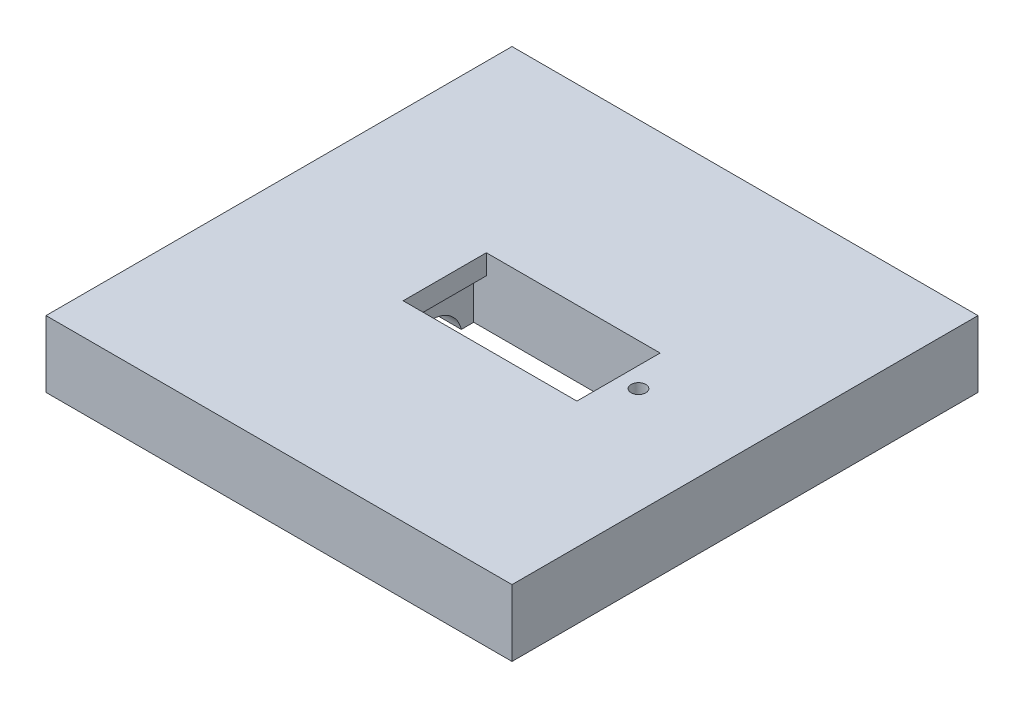
ISO-10303-21;
HEADER;
FILE_DESCRIPTION(('STEP AP214'),'2;1');
FILE_NAME('part.step','',(''),(''),'','','');
FILE_SCHEMA(('AUTOMOTIVE_DESIGN { 1 0 10303 214 1 1 1 1 }'));
ENDSEC;
DATA;
#1=APPLICATION_CONTEXT('core data for automotive mechanical design processes');
#2=APPLICATION_PROTOCOL_DEFINITION('international standard','automotive_design',2000,#1);
#3=PRODUCT_CONTEXT('',#1,'mechanical');
#4=PRODUCT('Part','Part','',(#3));
#5=PRODUCT_RELATED_PRODUCT_CATEGORY('part','',(#4));
#6=PRODUCT_DEFINITION_FORMATION('','',#4);
#7=PRODUCT_DEFINITION_CONTEXT('part definition',#1,'design');
#8=PRODUCT_DEFINITION('design','',#6,#7);
#9=PRODUCT_DEFINITION_SHAPE('','',#8);
#10=(LENGTH_UNIT() NAMED_UNIT(*) SI_UNIT(.MILLI.,.METRE.));
#11=(NAMED_UNIT(*) PLANE_ANGLE_UNIT() SI_UNIT($,.RADIAN.));
#12=(NAMED_UNIT(*) SI_UNIT($,.STERADIAN.) SOLID_ANGLE_UNIT());
#13=UNCERTAINTY_MEASURE_WITH_UNIT(LENGTH_MEASURE(1.E-05),#10,'distance_accuracy_value','');
#14=(GEOMETRIC_REPRESENTATION_CONTEXT(3) GLOBAL_UNCERTAINTY_ASSIGNED_CONTEXT((#13)) GLOBAL_UNIT_ASSIGNED_CONTEXT((#10,
#11,#12)) REPRESENTATION_CONTEXT('',''));
#15=CARTESIAN_POINT('',(0.,0.,0.));
#16=DIRECTION('',(0.,0.,1.));
#17=DIRECTION('',(1.,0.,0.));
#18=AXIS2_PLACEMENT_3D('',#15,#16,#17);
#19=CARTESIAN_POINT('',(-35.001,46.,22.1));
#20=DIRECTION('',(1.,0.,0.));
#21=DIRECTION('',(0.,0.,-1.));
#22=AXIS2_PLACEMENT_3D('',#19,#20,#21);
#23=CYLINDRICAL_SURFACE('',#22,4.50000000000001);
#24=DIRECTION('',(1.,0.,0.));
#25=VECTOR('',#24,1.);
#26=CARTESIAN_POINT('',(-35.001,45.0001693639848,17.7124792081079));
#27=LINE('',#26,#25);
#28=CARTESIAN_POINT('',(-35.,45.0001693639848,17.7124792081079));
#29=VERTEX_POINT('',#28);
#30=CARTESIAN_POINT('',(-12.,45.0001693639848,17.7124792081079));
#31=VERTEX_POINT('',#30);
#32=EDGE_CURVE('E331',#29,#31,#27,.T.);
#33=ORIENTED_EDGE('',*,*,#32,.T.);
#34=CARTESIAN_POINT('',(-12.,46.,22.1));
#35=DIRECTION('',(1.,0.,0.));
#36=DIRECTION('',(0.,0.,-1.));
#37=AXIS2_PLACEMENT_3D('',#34,#35,#36);
#38=CIRCLE('',#37,4.50000000000001);
#39=CARTESIAN_POINT('',(-12.,45.0001693639848,26.4875207918921));
#40=VERTEX_POINT('',#39);
#41=EDGE_CURVE('E238',#40,#31,#38,.F.);
#42=ORIENTED_EDGE('',*,*,#41,.F.);
#43=DIRECTION('',(1.,0.,0.));
#44=VECTOR('',#43,1.);
#45=CARTESIAN_POINT('',(-35.001,45.0001693639848,26.4875207918921));
#46=LINE('',#45,#44);
#47=CARTESIAN_POINT('',(-35.,45.0001693639848,26.4875207918921));
#48=VERTEX_POINT('',#47);
#49=EDGE_CURVE('E308',#40,#48,#46,.F.);
#50=ORIENTED_EDGE('',*,*,#49,.T.);
#51=CARTESIAN_POINT('',(-35.,46.,22.1));
#52=DIRECTION('',(1.,0.,0.));
#53=DIRECTION('',(0.,0.,-1.));
#54=AXIS2_PLACEMENT_3D('',#51,#52,#53);
#55=CIRCLE('',#54,4.50000000000001);
#56=EDGE_CURVE('E199',#48,#29,#55,.F.);
#57=ORIENTED_EDGE('',*,*,#56,.T.);
#58=EDGE_LOOP('',(#33,#42,#50,#57));
#59=FACE_BOUND('',#58,.T.);
#60=ADVANCED_FACE('F37',(#59),#23,.F.);
#61=CARTESIAN_POINT('',(-35.001,44.,0.));
#62=DIRECTION('',(1.,0.,0.));
#63=DIRECTION('',(0.,0.,-1.));
#64=AXIS2_PLACEMENT_3D('',#61,#62,#63);
#65=CYLINDRICAL_SURFACE('',#64,4.5);
#66=DIRECTION('',(1.,0.,0.));
#67=VECTOR('',#66,1.);
#68=CARTESIAN_POINT('',(-35.001,45.0001693639848,-4.38744358862266));
#69=LINE('',#68,#67);
#70=CARTESIAN_POINT('',(-35.,45.0001693639848,-4.38744358862266));
#71=VERTEX_POINT('',#70);
#72=CARTESIAN_POINT('',(-12.,45.0001693639848,-4.38744358862267));
#73=VERTEX_POINT('',#72);
#74=EDGE_CURVE('E271',#71,#73,#69,.T.);
#75=ORIENTED_EDGE('',*,*,#74,.T.);
#76=CARTESIAN_POINT('',(-12.,44.,0.));
#77=DIRECTION('',(1.,0.,0.));
#78=DIRECTION('',(0.,0.,-1.));
#79=AXIS2_PLACEMENT_3D('',#76,#77,#78);
#80=CIRCLE('',#79,4.5);
#81=CARTESIAN_POINT('',(-12.,45.0001693639848,4.38744358862267));
#82=VERTEX_POINT('',#81);
#83=EDGE_CURVE('E183',#82,#73,#80,.F.);
#84=ORIENTED_EDGE('',*,*,#83,.F.);
#85=DIRECTION('',(1.,0.,0.));
#86=VECTOR('',#85,1.);
#87=CARTESIAN_POINT('',(-35.001,45.0001693639848,4.38744358862267));
#88=LINE('',#87,#86);
#89=CARTESIAN_POINT('',(-35.,45.0001693639848,4.38744358862267));
#90=VERTEX_POINT('',#89);
#91=EDGE_CURVE('E277',#82,#90,#88,.F.);
#92=ORIENTED_EDGE('',*,*,#91,.T.);
#93=CARTESIAN_POINT('',(-35.,44.,0.));
#94=DIRECTION('',(1.,0.,0.));
#95=DIRECTION('',(0.,0.,-1.));
#96=AXIS2_PLACEMENT_3D('',#93,#94,#95);
#97=CIRCLE('',#96,4.5);
#98=EDGE_CURVE('E214',#90,#71,#97,.F.);
#99=ORIENTED_EDGE('',*,*,#98,.T.);
#100=EDGE_LOOP('',(#75,#84,#92,#99));
#101=FACE_BOUND('',#100,.T.);
#102=ADVANCED_FACE('F276',(#101),#65,.F.);
#103=CARTESIAN_POINT('',(35.,64.,-35.));
#104=DIRECTION('',(-1.,0.,0.));
#105=DIRECTION('',(0.,0.,1.));
#106=AXIS2_PLACEMENT_3D('',#103,#104,#105);
#107=PLANE('',#106);
#108=DIRECTION('',(0.,0.,-1.));
#109=VECTOR('',#108,1.);
#110=CARTESIAN_POINT('',(35.,45.0001693639848,0.));
#111=LINE('',#110,#109);
#112=CARTESIAN_POINT('',(35.,45.0001693639848,35.));
#113=VERTEX_POINT('',#112);
#114=CARTESIAN_POINT('',(35.,45.0001693639848,-35.));
#115=VERTEX_POINT('',#114);
#116=EDGE_CURVE('E326',#113,#115,#111,.T.);
#117=ORIENTED_EDGE('',*,*,#116,.T.);
#118=DIRECTION('',(0.,-1.,0.));
#119=VECTOR('',#118,1.);
#120=CARTESIAN_POINT('',(35.,64.,-35.));
#121=LINE('',#120,#119);
#122=CARTESIAN_POINT('',(35.,55.,-35.));
#123=VERTEX_POINT('',#122);
#124=EDGE_CURVE('E45',#123,#115,#121,.T.);
#125=ORIENTED_EDGE('',*,*,#124,.F.);
#126=DIRECTION('',(0.,0.,-1.));
#127=VECTOR('',#126,1.);
#128=CARTESIAN_POINT('',(35.,55.,35.));
#129=LINE('',#128,#127);
#130=CARTESIAN_POINT('',(35.,55.,35.));
#131=VERTEX_POINT('',#130);
#132=EDGE_CURVE('E240',#131,#123,#129,.T.);
#133=ORIENTED_EDGE('',*,*,#132,.F.);
#134=DIRECTION('',(0.,-1.,0.));
#135=VECTOR('',#134,1.);
#136=CARTESIAN_POINT('',(35.,64.,35.));
#137=LINE('',#136,#135);
#138=EDGE_CURVE('E225',#131,#113,#137,.T.);
#139=ORIENTED_EDGE('',*,*,#138,.T.);
#140=EDGE_LOOP('',(#117,#125,#133,#139));
#141=FACE_BOUND('',#140,.T.);
#142=ADVANCED_FACE('F39',(#141),#107,.F.);
#143=CARTESIAN_POINT('',(-35.,64.,-35.));
#144=DIRECTION('',(0.,0.,1.));
#145=DIRECTION('',(1.,0.,0.));
#146=AXIS2_PLACEMENT_3D('',#143,#144,#145);
#147=PLANE('',#146);
#148=DIRECTION('',(-1.,0.,0.));
#149=VECTOR('',#148,1.);
#150=CARTESIAN_POINT('',(0.,45.0001693639848,-35.));
#151=LINE('',#150,#149);
#152=CARTESIAN_POINT('',(-35.,45.0001693639848,-35.));
#153=VERTEX_POINT('',#152);
#154=EDGE_CURVE('E329',#115,#153,#151,.T.);
#155=ORIENTED_EDGE('',*,*,#154,.T.);
#156=DIRECTION('',(0.,-1.,0.));
#157=VECTOR('',#156,1.);
#158=CARTESIAN_POINT('',(-35.,64.,-35.));
#159=LINE('',#158,#157);
#160=CARTESIAN_POINT('',(-35.,55.,-35.));
#161=VERTEX_POINT('',#160);
#162=EDGE_CURVE('E232',#161,#153,#159,.T.);
#163=ORIENTED_EDGE('',*,*,#162,.F.);
#164=DIRECTION('',(1.,0.,0.));
#165=VECTOR('',#164,1.);
#166=CARTESIAN_POINT('',(-35.001,55.,-35.));
#167=LINE('',#166,#165);
#168=EDGE_CURVE('E256',#161,#123,#167,.T.);
#169=ORIENTED_EDGE('',*,*,#168,.T.);
#170=ORIENTED_EDGE('',*,*,#124,.T.);
#171=EDGE_LOOP('',(#155,#163,#169,#170));
#172=FACE_BOUND('',#171,.T.);
#173=ADVANCED_FACE('F342',(#172),#147,.F.);
#174=CARTESIAN_POINT('',(-35.,64.,-35.));
#175=DIRECTION('',(1.,0.,0.));
#176=DIRECTION('',(0.,0.,-1.));
#177=AXIS2_PLACEMENT_3D('',#174,#175,#176);
#178=PLANE('',#177);
#179=DIRECTION('',(0.,0.,1.));
#180=VECTOR('',#179,1.);
#181=CARTESIAN_POINT('',(-35.,45.0001693639848,0.));
#182=LINE('',#181,#180);
#183=CARTESIAN_POINT('',(-35.,45.0001693639848,35.));
#184=VERTEX_POINT('',#183);
#185=EDGE_CURVE('E318',#48,#184,#182,.T.);
#186=ORIENTED_EDGE('',*,*,#185,.T.);
#187=DIRECTION('',(0.,-1.,0.));
#188=VECTOR('',#187,1.);
#189=CARTESIAN_POINT('',(-35.,64.,35.));
#190=LINE('',#189,#188);
#191=CARTESIAN_POINT('',(-35.,55.,35.));
#192=VERTEX_POINT('',#191);
#193=EDGE_CURVE('E229',#192,#184,#190,.T.);
#194=ORIENTED_EDGE('',*,*,#193,.F.);
#195=DIRECTION('',(0.,0.,1.));
#196=VECTOR('',#195,1.);
#197=CARTESIAN_POINT('',(-35.,55.,35.));
#198=LINE('',#197,#196);
#199=EDGE_CURVE('E259',#161,#192,#198,.T.);
#200=ORIENTED_EDGE('',*,*,#199,.F.);
#201=ORIENTED_EDGE('',*,*,#162,.T.);
#202=EDGE_CURVE('E281',#153,#71,#182,.T.);
#203=ORIENTED_EDGE('',*,*,#202,.T.);
#204=ORIENTED_EDGE('',*,*,#98,.F.);
#205=EDGE_CURVE('E321',#90,#29,#182,.T.);
#206=ORIENTED_EDGE('',*,*,#205,.T.);
#207=ORIENTED_EDGE('',*,*,#56,.F.);
#208=EDGE_LOOP('',(#186,#194,#200,#201,#203,#204,#206,#207));
#209=FACE_BOUND('',#208,.T.);
#210=ADVANCED_FACE('F337',(#209),#178,.F.);
#211=CARTESIAN_POINT('',(-35.,64.,35.));
#212=DIRECTION('',(0.,0.,-1.));
#213=DIRECTION('',(-1.,0.,0.));
#214=AXIS2_PLACEMENT_3D('',#211,#212,#213);
#215=PLANE('',#214);
#216=DIRECTION('',(1.,0.,0.));
#217=VECTOR('',#216,1.);
#218=CARTESIAN_POINT('',(0.,45.0001693639848,35.));
#219=LINE('',#218,#217);
#220=EDGE_CURVE('E323',#184,#113,#219,.T.);
#221=ORIENTED_EDGE('',*,*,#220,.T.);
#222=ORIENTED_EDGE('',*,*,#138,.F.);
#223=DIRECTION('',(1.,0.,0.));
#224=VECTOR('',#223,1.);
#225=CARTESIAN_POINT('',(-35.001,55.,35.));
#226=LINE('',#225,#224);
#227=EDGE_CURVE('E245',#192,#131,#226,.T.);
#228=ORIENTED_EDGE('',*,*,#227,.F.);
#229=ORIENTED_EDGE('',*,*,#193,.T.);
#230=EDGE_LOOP('',(#221,#222,#228,#229));
#231=FACE_BOUND('',#230,.T.);
#232=ADVANCED_FACE('F348',(#231),#215,.F.);
#233=CARTESIAN_POINT('',(16.,39.,6.));
#234=DIRECTION('',(1.,0.,0.));
#235=DIRECTION('',(0.,0.,-1.));
#236=AXIS2_PLACEMENT_3D('',#233,#234,#235);
#237=PLANE('',#236);
#238=DIRECTION('',(0.,0.,1.));
#239=VECTOR('',#238,1.);
#240=CARTESIAN_POINT('',(16.,45.0001693639848,0.));
#241=LINE('',#240,#239);
#242=CARTESIAN_POINT('',(16.,45.0001693639848,-6.25));
#243=VERTEX_POINT('',#242);
#244=CARTESIAN_POINT('',(16.,45.0001693639848,6.25));
#245=VERTEX_POINT('',#244);
#246=EDGE_CURVE('E290',#243,#245,#241,.T.);
#247=ORIENTED_EDGE('',*,*,#246,.T.);
#248=DIRECTION('',(0.,1.,0.));
#249=VECTOR('',#248,1.);
#250=CARTESIAN_POINT('',(16.,39.,6.25));
#251=LINE('',#250,#249);
#252=CARTESIAN_POINT('',(16.,55.,6.25));
#253=VERTEX_POINT('',#252);
#254=EDGE_CURVE('E223',#245,#253,#251,.T.);
#255=ORIENTED_EDGE('',*,*,#254,.T.);
#256=DIRECTION('',(0.,0.,-1.));
#257=VECTOR('',#256,1.);
#258=CARTESIAN_POINT('',(16.,55.,6.));
#259=LINE('',#258,#257);
#260=CARTESIAN_POINT('',(16.,55.,-6.25));
#261=VERTEX_POINT('',#260);
#262=EDGE_CURVE('E196',#253,#261,#259,.T.);
#263=ORIENTED_EDGE('',*,*,#262,.T.);
#264=DIRECTION('',(0.,1.,0.));
#265=VECTOR('',#264,1.);
#266=CARTESIAN_POINT('',(16.,39.,-6.25));
#267=LINE('',#266,#265);
#268=EDGE_CURVE('E222',#243,#261,#267,.T.);
#269=ORIENTED_EDGE('',*,*,#268,.F.);
#270=EDGE_LOOP('',(#247,#255,#263,#269));
#271=FACE_BOUND('',#270,.T.);
#272=ADVANCED_FACE('F380',(#271),#237,.F.);
#273=CARTESIAN_POINT('',(16.,39.,6.25));
#274=DIRECTION('',(0.,0.,1.));
#275=DIRECTION('',(1.,0.,0.));
#276=AXIS2_PLACEMENT_3D('',#273,#274,#275);
#277=PLANE('',#276);
#278=DIRECTION('',(0.,-1.,0.));
#279=VECTOR('',#278,1.);
#280=CARTESIAN_POINT('',(-10.1,55.001,6.25));
#281=LINE('',#280,#279);
#282=CARTESIAN_POINT('',(-10.1,55.,6.25));
#283=VERTEX_POINT('',#282);
#284=CARTESIAN_POINT('',(-10.1,51.9986853970522,6.25));
#285=VERTEX_POINT('',#284);
#286=EDGE_CURVE('E171',#283,#285,#281,.T.);
#287=ORIENTED_EDGE('',*,*,#286,.F.);
#288=DIRECTION('',(1.,0.,0.));
#289=VECTOR('',#288,1.);
#290=CARTESIAN_POINT('',(16.,55.,6.25));
#291=LINE('',#290,#289);
#292=EDGE_CURVE('E194',#283,#253,#291,.T.);
#293=ORIENTED_EDGE('',*,*,#292,.T.);
#294=ORIENTED_EDGE('',*,*,#254,.F.);
#295=DIRECTION('',(-1.,0.,0.));
#296=VECTOR('',#295,1.);
#297=CARTESIAN_POINT('',(0.,45.0001693639848,6.25));
#298=LINE('',#297,#296);
#299=CARTESIAN_POINT('',(-12.,45.0001693639848,6.25));
#300=VERTEX_POINT('',#299);
#301=EDGE_CURVE('E288',#245,#300,#298,.T.);
#302=ORIENTED_EDGE('',*,*,#301,.T.);
#303=DIRECTION('',(0.,-1.,0.));
#304=VECTOR('',#303,1.);
#305=CARTESIAN_POINT('',(-12.,51.9986853970522,6.25));
#306=LINE('',#305,#304);
#307=CARTESIAN_POINT('',(-12.,51.9986853970522,6.25));
#308=VERTEX_POINT('',#307);
#309=EDGE_CURVE('E181',#308,#300,#306,.T.);
#310=ORIENTED_EDGE('',*,*,#309,.F.);
#311=DIRECTION('',(1.,0.,0.));
#312=VECTOR('',#311,1.);
#313=CARTESIAN_POINT('',(-12.,51.9986853970522,6.25));
#314=LINE('',#313,#312);
#315=EDGE_CURVE('E165',#308,#285,#314,.T.);
#316=ORIENTED_EDGE('',*,*,#315,.T.);
#317=EDGE_LOOP('',(#287,#293,#294,#302,#310,#316));
#318=FACE_BOUND('',#317,.T.);
#319=ADVANCED_FACE('F178',(#318),#277,.F.);
#320=CARTESIAN_POINT('',(-7.,39.,-6.25));
#321=DIRECTION('',(0.,0.,-1.));
#322=DIRECTION('',(-1.,0.,0.));
#323=AXIS2_PLACEMENT_3D('',#320,#321,#322);
#324=PLANE('',#323);
#325=DIRECTION('',(-1.,0.,0.));
#326=VECTOR('',#325,1.);
#327=CARTESIAN_POINT('',(-7.,55.,-6.25));
#328=LINE('',#327,#326);
#329=CARTESIAN_POINT('',(-10.1,55.,-6.25));
#330=VERTEX_POINT('',#329);
#331=EDGE_CURVE('E192',#261,#330,#328,.T.);
#332=ORIENTED_EDGE('',*,*,#331,.T.);
#333=DIRECTION('',(0.,-1.,0.));
#334=VECTOR('',#333,1.);
#335=CARTESIAN_POINT('',(-10.1,55.001,-6.25));
#336=LINE('',#335,#334);
#337=CARTESIAN_POINT('',(-10.1,51.9986853970522,-6.25));
#338=VERTEX_POINT('',#337);
#339=EDGE_CURVE('E52',#330,#338,#336,.T.);
#340=ORIENTED_EDGE('',*,*,#339,.T.);
#341=DIRECTION('',(1.,0.,0.));
#342=VECTOR('',#341,1.);
#343=CARTESIAN_POINT('',(-12.,51.9986853970522,-6.25));
#344=LINE('',#343,#342);
#345=CARTESIAN_POINT('',(-12.,51.9986853970522,-6.25));
#346=VERTEX_POINT('',#345);
#347=EDGE_CURVE('E167',#346,#338,#344,.T.);
#348=ORIENTED_EDGE('',*,*,#347,.F.);
#349=DIRECTION('',(0.,1.,0.));
#350=VECTOR('',#349,1.);
#351=CARTESIAN_POINT('',(-12.,39.,-6.25));
#352=LINE('',#351,#350);
#353=CARTESIAN_POINT('',(-12.,45.0001693639848,-6.25));
#354=VERTEX_POINT('',#353);
#355=EDGE_CURVE('E262',#354,#346,#352,.T.);
#356=ORIENTED_EDGE('',*,*,#355,.F.);
#357=DIRECTION('',(1.,0.,0.));
#358=VECTOR('',#357,1.);
#359=CARTESIAN_POINT('',(0.,45.0001693639848,-6.25));
#360=LINE('',#359,#358);
#361=EDGE_CURVE('E285',#354,#243,#360,.T.);
#362=ORIENTED_EDGE('',*,*,#361,.T.);
#363=ORIENTED_EDGE('',*,*,#268,.T.);
#364=EDGE_LOOP('',(#332,#340,#348,#356,#362,#363));
#365=FACE_BOUND('',#364,.T.);
#366=ADVANCED_FACE('F370',(#365),#324,.F.);
#367=CARTESIAN_POINT('',(-7.,51.,28.2));
#368=DIRECTION('',(0.,0.,1.));
#369=DIRECTION('',(1.,0.,0.));
#370=AXIS2_PLACEMENT_3D('',#367,#368,#369);
#371=PLANE('',#370);
#372=DIRECTION('',(-1.,0.,0.));
#373=VECTOR('',#372,1.);
#374=CARTESIAN_POINT('',(0.,45.0001693639848,28.2));
#375=LINE('',#374,#373);
#376=CARTESIAN_POINT('',(16.,45.0001693639848,28.2));
#377=VERTEX_POINT('',#376);
#378=CARTESIAN_POINT('',(-12.,45.0001693639848,28.2));
#379=VERTEX_POINT('',#378);
#380=EDGE_CURVE('E306',#377,#379,#375,.T.);
#381=ORIENTED_EDGE('',*,*,#380,.T.);
#382=DIRECTION('',(0.,-1.,0.));
#383=VECTOR('',#382,1.);
#384=CARTESIAN_POINT('',(-12.,51.,28.2));
#385=LINE('',#384,#383);
#386=CARTESIAN_POINT('',(-12.,51.,28.2));
#387=VERTEX_POINT('',#386);
#388=EDGE_CURVE('E241',#387,#379,#385,.T.);
#389=ORIENTED_EDGE('',*,*,#388,.F.);
#390=DIRECTION('',(-1.,0.,0.));
#391=VECTOR('',#390,1.);
#392=CARTESIAN_POINT('',(-7.,51.,28.2));
#393=LINE('',#392,#391);
#394=CARTESIAN_POINT('',(16.,51.,28.2));
#395=VERTEX_POINT('',#394);
#396=EDGE_CURVE('E202',#395,#387,#393,.T.);
#397=ORIENTED_EDGE('',*,*,#396,.F.);
#398=DIRECTION('',(0.,-1.,0.));
#399=VECTOR('',#398,1.);
#400=CARTESIAN_POINT('',(16.,51.,28.2));
#401=LINE('',#400,#399);
#402=EDGE_CURVE('E211',#395,#377,#401,.T.);
#403=ORIENTED_EDGE('',*,*,#402,.T.);
#404=EDGE_LOOP('',(#381,#389,#397,#403));
#405=FACE_BOUND('',#404,.T.);
#406=ADVANCED_FACE('F305',(#405),#371,.F.);
#407=CARTESIAN_POINT('',(16.,51.,16.));
#408=DIRECTION('',(1.,0.,0.));
#409=DIRECTION('',(0.,0.,-1.));
#410=AXIS2_PLACEMENT_3D('',#407,#408,#409);
#411=PLANE('',#410);
#412=DIRECTION('',(0.,0.,1.));
#413=VECTOR('',#412,1.);
#414=CARTESIAN_POINT('',(16.,45.0001693639848,0.));
#415=LINE('',#414,#413);
#416=CARTESIAN_POINT('',(16.,45.0001693639848,16.));
#417=VERTEX_POINT('',#416);
#418=EDGE_CURVE('E312',#417,#377,#415,.T.);
#419=ORIENTED_EDGE('',*,*,#418,.T.);
#420=ORIENTED_EDGE('',*,*,#402,.F.);
#421=DIRECTION('',(0.,0.,1.));
#422=VECTOR('',#421,1.);
#423=CARTESIAN_POINT('',(16.,51.,16.));
#424=LINE('',#423,#422);
#425=CARTESIAN_POINT('',(16.,51.,16.));
#426=VERTEX_POINT('',#425);
#427=EDGE_CURVE('E207',#426,#395,#424,.T.);
#428=ORIENTED_EDGE('',*,*,#427,.F.);
#429=DIRECTION('',(0.,-1.,0.));
#430=VECTOR('',#429,1.);
#431=CARTESIAN_POINT('',(16.,51.,16.));
#432=LINE('',#431,#430);
#433=EDGE_CURVE('E210',#426,#417,#432,.T.);
#434=ORIENTED_EDGE('',*,*,#433,.T.);
#435=EDGE_LOOP('',(#419,#420,#428,#434));
#436=FACE_BOUND('',#435,.T.);
#437=ADVANCED_FACE('F363',(#436),#411,.F.);
#438=CARTESIAN_POINT('',(-7.,51.,16.));
#439=DIRECTION('',(0.,0.,-1.));
#440=DIRECTION('',(-1.,0.,0.));
#441=AXIS2_PLACEMENT_3D('',#438,#439,#440);
#442=PLANE('',#441);
#443=DIRECTION('',(1.,0.,0.));
#444=VECTOR('',#443,1.);
#445=CARTESIAN_POINT('',(0.,45.0001693639848,16.));
#446=LINE('',#445,#444);
#447=CARTESIAN_POINT('',(-12.,45.0001693639848,16.));
#448=VERTEX_POINT('',#447);
#449=EDGE_CURVE('E60',#448,#417,#446,.T.);
#450=ORIENTED_EDGE('',*,*,#449,.T.);
#451=ORIENTED_EDGE('',*,*,#433,.F.);
#452=DIRECTION('',(1.,0.,0.));
#453=VECTOR('',#452,1.);
#454=CARTESIAN_POINT('',(-7.,51.,16.));
#455=LINE('',#454,#453);
#456=CARTESIAN_POINT('',(-12.,51.,16.));
#457=VERTEX_POINT('',#456);
#458=EDGE_CURVE('E204',#457,#426,#455,.T.);
#459=ORIENTED_EDGE('',*,*,#458,.F.);
#460=DIRECTION('',(0.,1.,0.));
#461=VECTOR('',#460,1.);
#462=CARTESIAN_POINT('',(-12.,51.,16.));
#463=LINE('',#462,#461);
#464=EDGE_CURVE('E252',#448,#457,#463,.T.);
#465=ORIENTED_EDGE('',*,*,#464,.F.);
#466=EDGE_LOOP('',(#450,#451,#459,#465));
#467=FACE_BOUND('',#466,.T.);
#468=ADVANCED_FACE('F298',(#467),#442,.F.);
#469=CARTESIAN_POINT('',(-12.,0.,0.));
#470=DIRECTION('',(1.,0.,0.));
#471=DIRECTION('',(0.,0.,-1.));
#472=AXIS2_PLACEMENT_3D('',#469,#470,#471);
#473=PLANE('',#472);
#474=ORIENTED_EDGE('',*,*,#309,.T.);
#475=DIRECTION('',(0.,0.,1.));
#476=VECTOR('',#475,1.);
#477=CARTESIAN_POINT('',(-12.,45.0001693639848,0.));
#478=LINE('',#477,#476);
#479=EDGE_CURVE('E267',#82,#300,#478,.T.);
#480=ORIENTED_EDGE('',*,*,#479,.F.);
#481=ORIENTED_EDGE('',*,*,#83,.T.);
#482=EDGE_CURVE('E270',#354,#73,#478,.T.);
#483=ORIENTED_EDGE('',*,*,#482,.F.);
#484=ORIENTED_EDGE('',*,*,#355,.T.);
#485=DIRECTION('',(0.,0.,1.));
#486=VECTOR('',#485,1.);
#487=CARTESIAN_POINT('',(-12.,51.9986853970522,-6.25));
#488=LINE('',#487,#486);
#489=EDGE_CURVE('E263',#346,#308,#488,.T.);
#490=ORIENTED_EDGE('',*,*,#489,.T.);
#491=EDGE_LOOP('',(#474,#480,#481,#483,#484,#490));
#492=FACE_BOUND('',#491,.T.);
#493=ADVANCED_FACE('F266',(#492),#473,.T.);
#494=CARTESIAN_POINT('',(-12.,0.,0.));
#495=DIRECTION('',(1.,0.,0.));
#496=DIRECTION('',(0.,0.,-1.));
#497=AXIS2_PLACEMENT_3D('',#494,#495,#496);
#498=PLANE('',#497);
#499=ORIENTED_EDGE('',*,*,#388,.T.);
#500=DIRECTION('',(0.,0.,1.));
#501=VECTOR('',#500,1.);
#502=CARTESIAN_POINT('',(-12.,45.0001693639848,0.));
#503=LINE('',#502,#501);
#504=EDGE_CURVE('E309',#40,#379,#503,.T.);
#505=ORIENTED_EDGE('',*,*,#504,.F.);
#506=ORIENTED_EDGE('',*,*,#41,.T.);
#507=EDGE_CURVE('E296',#448,#31,#503,.T.);
#508=ORIENTED_EDGE('',*,*,#507,.F.);
#509=ORIENTED_EDGE('',*,*,#464,.T.);
#510=DIRECTION('',(0.,0.,1.));
#511=VECTOR('',#510,1.);
#512=CARTESIAN_POINT('',(-12.,51.,16.));
#513=LINE('',#512,#511);
#514=EDGE_CURVE('E248',#457,#387,#513,.T.);
#515=ORIENTED_EDGE('',*,*,#514,.T.);
#516=EDGE_LOOP('',(#499,#505,#506,#508,#509,#515));
#517=FACE_BOUND('',#516,.T.);
#518=ADVANCED_FACE('F294',(#517),#498,.T.);
#519=CARTESIAN_POINT('',(0.,51.,0.));
#520=DIRECTION('',(0.,-1.,0.));
#521=DIRECTION('',(0.,0.,-1.));
#522=AXIS2_PLACEMENT_3D('',#519,#520,#521);
#523=PLANE('',#522);
#524=ORIENTED_EDGE('',*,*,#396,.T.);
#525=ORIENTED_EDGE('',*,*,#514,.F.);
#526=ORIENTED_EDGE('',*,*,#458,.T.);
#527=ORIENTED_EDGE('',*,*,#427,.T.);
#528=EDGE_LOOP('',(#524,#525,#526,#527));
#529=FACE_BOUND('',#528,.T.);
#530=ADVANCED_FACE('F301',(#529),#523,.T.);
#531=CARTESIAN_POINT('',(0.,55.,0.));
#532=DIRECTION('',(0.,-1.,0.));
#533=DIRECTION('',(0.,0.,-1.));
#534=AXIS2_PLACEMENT_3D('',#531,#532,#533);
#535=PLANE('',#534);
#536=ORIENTED_EDGE('',*,*,#292,.F.);
#537=DIRECTION('',(0.,0.,-1.));
#538=VECTOR('',#537,1.);
#539=CARTESIAN_POINT('',(-10.1,55.,0.));
#540=LINE('',#539,#538);
#541=EDGE_CURVE('E174',#283,#330,#540,.T.);
#542=ORIENTED_EDGE('',*,*,#541,.T.);
#543=ORIENTED_EDGE('',*,*,#331,.F.);
#544=ORIENTED_EDGE('',*,*,#262,.F.);
#545=EDGE_LOOP('',(#536,#542,#543,#544));
#546=FACE_BOUND('',#545,.T.);
#547=CARTESIAN_POINT('',(19.,55.,0.));
#548=DIRECTION('',(0.,-1.,0.));
#549=DIRECTION('',(0.,0.,-1.));
#550=AXIS2_PLACEMENT_3D('',#547,#548,#549);
#551=CIRCLE('',#550,1.1);
#552=CARTESIAN_POINT('',(19.,55.,-1.1));
#553=VERTEX_POINT('',#552);
#554=EDGE_CURVE('E186',#553,#553,#551,.F.);
#555=ORIENTED_EDGE('',*,*,#554,.F.);
#556=EDGE_LOOP('',(#555));
#557=FACE_BOUND('',#556,.T.);
#558=ORIENTED_EDGE('',*,*,#199,.T.);
#559=ORIENTED_EDGE('',*,*,#227,.T.);
#560=ORIENTED_EDGE('',*,*,#132,.T.);
#561=ORIENTED_EDGE('',*,*,#168,.F.);
#562=EDGE_LOOP('',(#558,#559,#560,#561));
#563=FACE_BOUND('',#562,.T.);
#564=ADVANCED_FACE('F359',(#546,#557,#563),#535,.F.);
#565=CARTESIAN_POINT('',(19.,50.,0.));
#566=DIRECTION('',(0.,1.,0.));
#567=DIRECTION('',(0.,0.,1.));
#568=AXIS2_PLACEMENT_3D('',#565,#566,#567);
#569=PLANE('',#568);
#570=CARTESIAN_POINT('',(19.,50.,0.));
#571=DIRECTION('',(0.,1.,0.));
#572=DIRECTION('',(0.,0.,1.));
#573=AXIS2_PLACEMENT_3D('',#570,#571,#572);
#574=CIRCLE('',#573,1.1);
#575=CARTESIAN_POINT('',(19.,50.,1.1));
#576=VERTEX_POINT('',#575);
#577=EDGE_CURVE('E219',#576,#576,#574,.T.);
#578=ORIENTED_EDGE('',*,*,#577,.T.);
#579=EDGE_LOOP('',(#578));
#580=FACE_BOUND('',#579,.T.);
#581=ADVANCED_FACE('F372',(#580),#569,.T.);
#582=CARTESIAN_POINT('',(19.,50.,0.));
#583=DIRECTION('',(0.,1.,0.));
#584=DIRECTION('',(0.,0.,1.));
#585=AXIS2_PLACEMENT_3D('',#582,#583,#584);
#586=CYLINDRICAL_SURFACE('',#585,1.1);
#587=ORIENTED_EDGE('',*,*,#554,.T.);
#588=EDGE_LOOP('',(#587));
#589=FACE_BOUND('',#588,.T.);
#590=ORIENTED_EDGE('',*,*,#577,.F.);
#591=EDGE_LOOP('',(#590));
#592=FACE_BOUND('',#591,.T.);
#593=ADVANCED_FACE('F375',(#589,#592),#586,.F.);
#594=CARTESIAN_POINT('',(-12.,51.9986853970522,-6.25));
#595=DIRECTION('',(0.,1.,0.));
#596=DIRECTION('',(0.,0.,1.));
#597=AXIS2_PLACEMENT_3D('',#594,#595,#596);
#598=PLANE('',#597);
#599=ORIENTED_EDGE('',*,*,#347,.T.);
#600=DIRECTION('',(0.,0.,1.));
#601=VECTOR('',#600,1.);
#602=CARTESIAN_POINT('',(-10.1,51.9986853970522,-6.25));
#603=LINE('',#602,#601);
#604=EDGE_CURVE('E11',#338,#285,#603,.T.);
#605=ORIENTED_EDGE('',*,*,#604,.T.);
#606=ORIENTED_EDGE('',*,*,#315,.F.);
#607=ORIENTED_EDGE('',*,*,#489,.F.);
#608=EDGE_LOOP('',(#599,#605,#606,#607));
#609=FACE_BOUND('',#608,.T.);
#610=ADVANCED_FACE('F162',(#609),#598,.F.);
#611=CARTESIAN_POINT('',(0.,45.0001693639848,0.));
#612=DIRECTION('',(0.,-1.,0.));
#613=DIRECTION('',(0.,0.,-1.));
#614=AXIS2_PLACEMENT_3D('',#611,#612,#613);
#615=PLANE('',#614);
#616=ORIENTED_EDGE('',*,*,#361,.F.);
#617=ORIENTED_EDGE('',*,*,#482,.T.);
#618=ORIENTED_EDGE('',*,*,#74,.F.);
#619=ORIENTED_EDGE('',*,*,#202,.F.);
#620=ORIENTED_EDGE('',*,*,#154,.F.);
#621=ORIENTED_EDGE('',*,*,#116,.F.);
#622=ORIENTED_EDGE('',*,*,#220,.F.);
#623=ORIENTED_EDGE('',*,*,#185,.F.);
#624=ORIENTED_EDGE('',*,*,#49,.F.);
#625=ORIENTED_EDGE('',*,*,#504,.T.);
#626=ORIENTED_EDGE('',*,*,#380,.F.);
#627=ORIENTED_EDGE('',*,*,#418,.F.);
#628=ORIENTED_EDGE('',*,*,#449,.F.);
#629=ORIENTED_EDGE('',*,*,#507,.T.);
#630=ORIENTED_EDGE('',*,*,#32,.F.);
#631=ORIENTED_EDGE('',*,*,#205,.F.);
#632=ORIENTED_EDGE('',*,*,#91,.F.);
#633=ORIENTED_EDGE('',*,*,#479,.T.);
#634=ORIENTED_EDGE('',*,*,#301,.F.);
#635=ORIENTED_EDGE('',*,*,#246,.F.);
#636=EDGE_LOOP('',(#616,#617,#618,#619,#620,#621,#622,#623,#624,#625,#626,#627,#628,#629,#630,
#631,#632,#633,#634,#635));
#637=FACE_BOUND('',#636,.T.);
#638=ADVANCED_FACE('F340',(#637),#615,.T.);
#639=CARTESIAN_POINT('',(-10.1,55.001,6.25));
#640=DIRECTION('',(-1.,0.,0.));
#641=DIRECTION('',(0.,0.,1.));
#642=AXIS2_PLACEMENT_3D('',#639,#640,#641);
#643=PLANE('',#642);
#644=ORIENTED_EDGE('',*,*,#541,.F.);
#645=ORIENTED_EDGE('',*,*,#286,.T.);
#646=ORIENTED_EDGE('',*,*,#604,.F.);
#647=ORIENTED_EDGE('',*,*,#339,.F.);
#648=EDGE_LOOP('',(#644,#645,#646,#647));
#649=FACE_BOUND('',#648,.T.);
#650=ADVANCED_FACE('F172',(#649),#643,.F.);
#651=CLOSED_SHELL('',(#60,#102,#142,#173,#210,#232,#272,#319,#366,#406,#437,#468,#493,#518,#530,
#564,#581,#593,#610,#638,#650));
#652=MANIFOLD_SOLID_BREP('B2',#651);
#653=ADVANCED_BREP_SHAPE_REPRESENTATION('',(#18,#652),#14);
#654=SHAPE_DEFINITION_REPRESENTATION(#9,#653);
ENDSEC;
END-ISO-10303-21;
